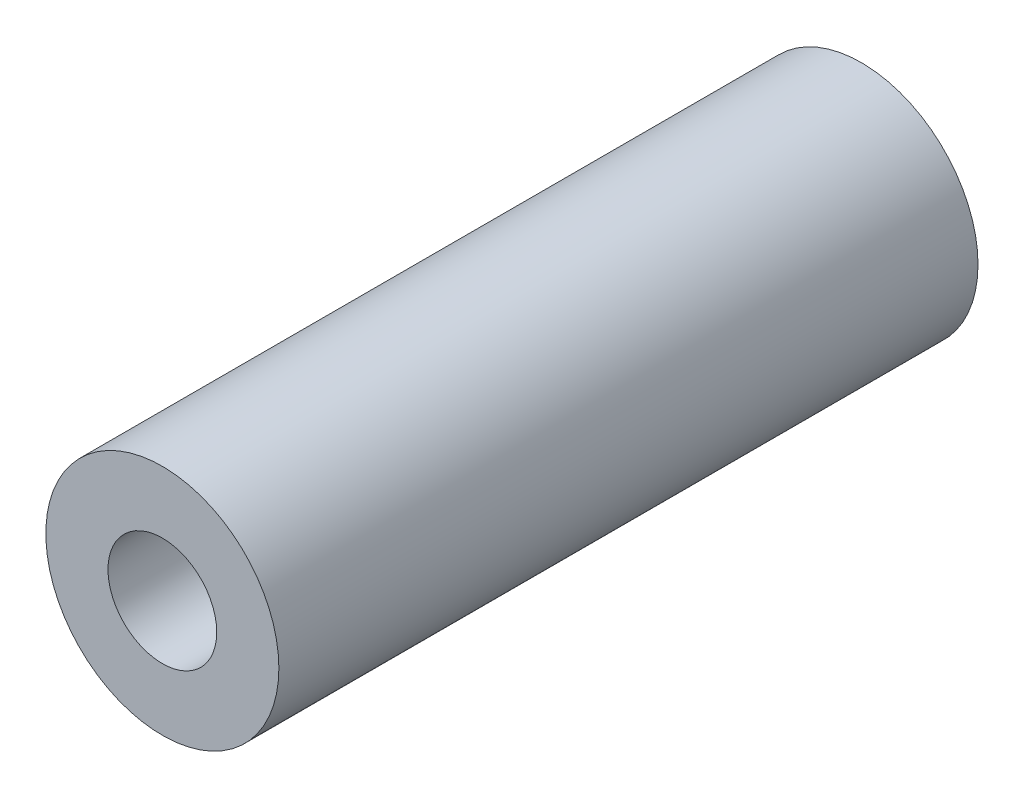
ISO-10303-21;
HEADER;
FILE_DESCRIPTION(('STEP AP214'),'2;1');
FILE_NAME('part.step','',(''),(''),'','','');
FILE_SCHEMA(('AUTOMOTIVE_DESIGN { 1 0 10303 214 1 1 1 1 }'));
ENDSEC;
DATA;
#1=APPLICATION_CONTEXT('core data for automotive mechanical design processes');
#2=APPLICATION_PROTOCOL_DEFINITION('international standard','automotive_design',2000,#1);
#3=PRODUCT_CONTEXT('',#1,'mechanical');
#4=PRODUCT('Part','Part','',(#3));
#5=PRODUCT_RELATED_PRODUCT_CATEGORY('part','',(#4));
#6=PRODUCT_DEFINITION_FORMATION('','',#4);
#7=PRODUCT_DEFINITION_CONTEXT('part definition',#1,'design');
#8=PRODUCT_DEFINITION('design','',#6,#7);
#9=PRODUCT_DEFINITION_SHAPE('','',#8);
#10=(LENGTH_UNIT() NAMED_UNIT(*) SI_UNIT(.MILLI.,.METRE.));
#11=(NAMED_UNIT(*) PLANE_ANGLE_UNIT() SI_UNIT($,.RADIAN.));
#12=(NAMED_UNIT(*) SI_UNIT($,.STERADIAN.) SOLID_ANGLE_UNIT());
#13=UNCERTAINTY_MEASURE_WITH_UNIT(LENGTH_MEASURE(1.E-05),#10,'distance_accuracy_value','');
#14=(GEOMETRIC_REPRESENTATION_CONTEXT(3) GLOBAL_UNCERTAINTY_ASSIGNED_CONTEXT((#13)) GLOBAL_UNIT_ASSIGNED_CONTEXT((#10,
#11,#12)) REPRESENTATION_CONTEXT('',''));
#15=CARTESIAN_POINT('',(0.,0.,0.));
#16=DIRECTION('',(0.,0.,1.));
#17=DIRECTION('',(1.,0.,0.));
#18=AXIS2_PLACEMENT_3D('',#15,#16,#17);
#19=CARTESIAN_POINT('',(-64.9999999999999,-1.2490009027033E-12,44.9999999999988));
#20=DIRECTION('',(0.,0.,0.999999999999981));
#21=DIRECTION('',(1.,0.,0.));
#22=AXIS2_PLACEMENT_3D('',#19,#20,#21);
#23=PLANE('',#22);
#24=CARTESIAN_POINT('',(-64.9999999999999,-1.2490009027033E-12,44.9999999999988));
#25=DIRECTION('',(0.,0.,0.999999999999981));
#26=DIRECTION('',(1.,0.,0.));
#27=AXIS2_PLACEMENT_3D('',#24,#25,#26);
#28=CIRCLE('',#27,15.);
#29=CARTESIAN_POINT('',(-50.,-1.2490009027033E-12,44.9999999999988));
#30=VERTEX_POINT('',#29);
#31=EDGE_CURVE('E10',#30,#30,#28,.T.);
#32=ORIENTED_EDGE('',*,*,#31,.T.);
#33=EDGE_LOOP('',(#32));
#34=FACE_BOUND('',#33,.T.);
#35=CARTESIAN_POINT('',(-64.9999999999999,-1.2490009027033E-12,44.9999999999988));
#36=DIRECTION('',(0.,0.,0.999999999999981));
#37=DIRECTION('',(1.,0.,0.));
#38=AXIS2_PLACEMENT_3D('',#35,#36,#37);
#39=CIRCLE('',#38,7.);
#40=CARTESIAN_POINT('',(-58.,-1.2490009027033E-12,44.9999999999988));
#41=VERTEX_POINT('',#40);
#42=EDGE_CURVE('E45',#41,#41,#39,.T.);
#43=ORIENTED_EDGE('',*,*,#42,.F.);
#44=EDGE_LOOP('',(#43));
#45=FACE_BOUND('',#44,.T.);
#46=ADVANCED_FACE('F34',(#34,#45),#23,.T.);
#47=CARTESIAN_POINT('',(-65.0000000000003,1.11022302462516E-13,-44.9999999999988));
#48=DIRECTION('',(0.,0.,0.999999999999981));
#49=DIRECTION('',(1.,0.,0.));
#50=AXIS2_PLACEMENT_3D('',#47,#48,#49);
#51=PLANE('',#50);
#52=CARTESIAN_POINT('',(-65.0000000000003,1.11022302462516E-13,-44.9999999999988));
#53=DIRECTION('',(0.,0.,0.999999999999981));
#54=DIRECTION('',(1.,0.,0.));
#55=AXIS2_PLACEMENT_3D('',#52,#53,#54);
#56=CIRCLE('',#55,15.);
#57=CARTESIAN_POINT('',(-50.0000000000003,1.11022302462516E-13,-44.9999999999988));
#58=VERTEX_POINT('',#57);
#59=EDGE_CURVE('E38',#58,#58,#56,.T.);
#60=ORIENTED_EDGE('',*,*,#59,.F.);
#61=EDGE_LOOP('',(#60));
#62=FACE_BOUND('',#61,.T.);
#63=CARTESIAN_POINT('',(-65.0000000000003,1.11022302462516E-13,-44.9999999999988));
#64=DIRECTION('',(0.,0.,0.999999999999981));
#65=DIRECTION('',(1.,0.,0.));
#66=AXIS2_PLACEMENT_3D('',#63,#64,#65);
#67=CIRCLE('',#66,7.);
#68=CARTESIAN_POINT('',(-58.0000000000003,1.11022302462516E-13,-44.9999999999988));
#69=VERTEX_POINT('',#68);
#70=EDGE_CURVE('E47',#69,#69,#67,.T.);
#71=ORIENTED_EDGE('',*,*,#70,.T.);
#72=EDGE_LOOP('',(#71));
#73=FACE_BOUND('',#72,.T.);
#74=ADVANCED_FACE('F57',(#62,#73),#51,.F.);
#75=CARTESIAN_POINT('',(-64.9999999999999,-1.2490009027033E-12,44.9999999999988));
#76=DIRECTION('',(0.,0.,-0.999999999999981));
#77=DIRECTION('',(-1.,0.,0.));
#78=AXIS2_PLACEMENT_3D('',#75,#76,#77);
#79=CYLINDRICAL_SURFACE('',#78,15.);
#80=ORIENTED_EDGE('',*,*,#31,.F.);
#81=EDGE_LOOP('',(#80));
#82=FACE_BOUND('',#81,.T.);
#83=ORIENTED_EDGE('',*,*,#59,.T.);
#84=EDGE_LOOP('',(#83));
#85=FACE_BOUND('',#84,.T.);
#86=ADVANCED_FACE('F36',(#82,#85),#79,.T.);
#87=CARTESIAN_POINT('',(-64.9999999999999,-1.2490009027033E-12,44.9999999999988));
#88=DIRECTION('',(0.,0.,-0.999999999999981));
#89=DIRECTION('',(-1.,0.,0.));
#90=AXIS2_PLACEMENT_3D('',#87,#88,#89);
#91=CYLINDRICAL_SURFACE('',#90,7.);
#92=ORIENTED_EDGE('',*,*,#42,.T.);
#93=EDGE_LOOP('',(#92));
#94=FACE_BOUND('',#93,.T.);
#95=ORIENTED_EDGE('',*,*,#70,.F.);
#96=EDGE_LOOP('',(#95));
#97=FACE_BOUND('',#96,.T.);
#98=ADVANCED_FACE('F53',(#94,#97),#91,.F.);
#99=CLOSED_SHELL('',(#46,#74,#86,#98));
#100=MANIFOLD_SOLID_BREP('B2',#99);
#101=ADVANCED_BREP_SHAPE_REPRESENTATION('',(#18,#100),#14);
#102=SHAPE_DEFINITION_REPRESENTATION(#9,#101);
ENDSEC;
END-ISO-10303-21;
